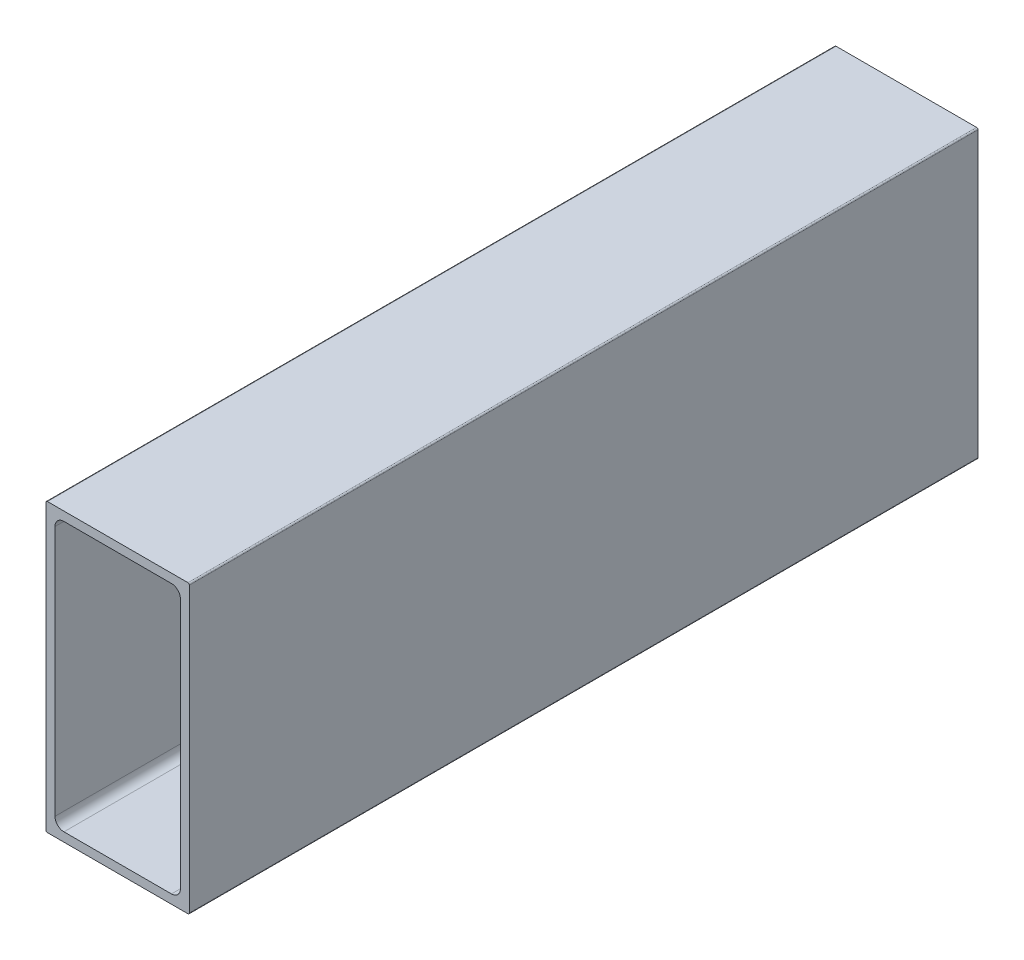
ISO-10303-21;
HEADER;
FILE_DESCRIPTION(('STEP AP214'),'2;1');
FILE_NAME('part.step','',(''),(''),'','','');
FILE_SCHEMA(('AUTOMOTIVE_DESIGN { 1 0 10303 214 1 1 1 1 }'));
ENDSEC;
DATA;
#1=APPLICATION_CONTEXT('core data for automotive mechanical design processes');
#2=APPLICATION_PROTOCOL_DEFINITION('international standard','automotive_design',2000,#1);
#3=PRODUCT_CONTEXT('',#1,'mechanical');
#4=PRODUCT('Part','Part','',(#3));
#5=PRODUCT_RELATED_PRODUCT_CATEGORY('part','',(#4));
#6=PRODUCT_DEFINITION_FORMATION('','',#4);
#7=PRODUCT_DEFINITION_CONTEXT('part definition',#1,'design');
#8=PRODUCT_DEFINITION('design','',#6,#7);
#9=PRODUCT_DEFINITION_SHAPE('','',#8);
#10=(LENGTH_UNIT() NAMED_UNIT(*) SI_UNIT(.MILLI.,.METRE.));
#11=(NAMED_UNIT(*) PLANE_ANGLE_UNIT() SI_UNIT($,.RADIAN.));
#12=(NAMED_UNIT(*) SI_UNIT($,.STERADIAN.) SOLID_ANGLE_UNIT());
#13=UNCERTAINTY_MEASURE_WITH_UNIT(LENGTH_MEASURE(1.E-05),#10,'distance_accuracy_value','');
#14=(GEOMETRIC_REPRESENTATION_CONTEXT(3) GLOBAL_UNCERTAINTY_ASSIGNED_CONTEXT((#13)) GLOBAL_UNIT_ASSIGNED_CONTEXT((#10,
#11,#12)) REPRESENTATION_CONTEXT('',''));
#15=CARTESIAN_POINT('',(0.,0.,0.));
#16=DIRECTION('',(0.,0.,1.));
#17=DIRECTION('',(1.,0.,0.));
#18=AXIS2_PLACEMENT_3D('',#15,#16,#17);
#19=CARTESIAN_POINT('',(12.446,25.146,139.7));
#20=DIRECTION('',(0.,0.,-1.));
#21=DIRECTION('',(-1.,0.,0.));
#22=AXIS2_PLACEMENT_3D('',#19,#20,#21);
#23=CYLINDRICAL_SURFACE('',#22,0.253999999999998);
#24=CARTESIAN_POINT('',(12.446,25.146,0.));
#25=DIRECTION('',(0.,0.,-1.));
#26=DIRECTION('',(-1.,0.,0.));
#27=AXIS2_PLACEMENT_3D('',#24,#25,#26);
#28=CIRCLE('',#27,0.253999999999998);
#29=CARTESIAN_POINT('',(12.446,25.4,0.));
#30=VERTEX_POINT('',#29);
#31=CARTESIAN_POINT('',(12.7,25.146,0.));
#32=VERTEX_POINT('',#31);
#33=EDGE_CURVE('E228',#30,#32,#28,.T.);
#34=ORIENTED_EDGE('',*,*,#33,.F.);
#35=DIRECTION('',(0.,0.,-1.));
#36=VECTOR('',#35,1.);
#37=CARTESIAN_POINT('',(12.446,25.4,139.7));
#38=LINE('',#37,#36);
#39=CARTESIAN_POINT('',(12.446,25.4,139.7));
#40=VERTEX_POINT('',#39);
#41=EDGE_CURVE('E11',#40,#30,#38,.T.);
#42=ORIENTED_EDGE('',*,*,#41,.F.);
#43=CARTESIAN_POINT('',(12.446,25.146,139.7));
#44=DIRECTION('',(0.,0.,-1.));
#45=DIRECTION('',(-1.,0.,0.));
#46=AXIS2_PLACEMENT_3D('',#43,#44,#45);
#47=CIRCLE('',#46,0.253999999999998);
#48=CARTESIAN_POINT('',(12.7,25.146,139.7));
#49=VERTEX_POINT('',#48);
#50=EDGE_CURVE('E246',#40,#49,#47,.T.);
#51=ORIENTED_EDGE('',*,*,#50,.T.);
#52=DIRECTION('',(0.,0.,-1.));
#53=VECTOR('',#52,1.);
#54=CARTESIAN_POINT('',(12.7,25.146,139.7));
#55=LINE('',#54,#53);
#56=EDGE_CURVE('E42',#49,#32,#55,.T.);
#57=ORIENTED_EDGE('',*,*,#56,.T.);
#58=EDGE_LOOP('',(#34,#42,#51,#57));
#59=FACE_BOUND('',#58,.T.);
#60=ADVANCED_FACE('F39',(#59),#23,.T.);
#61=CARTESIAN_POINT('',(-12.446,25.4,139.7));
#62=DIRECTION('',(0.,1.,0.));
#63=DIRECTION('',(0.,0.,1.));
#64=AXIS2_PLACEMENT_3D('',#61,#62,#63);
#65=PLANE('',#64);
#66=DIRECTION('',(1.,0.,0.));
#67=VECTOR('',#66,1.);
#68=CARTESIAN_POINT('',(-12.446,25.4,0.));
#69=LINE('',#68,#67);
#70=CARTESIAN_POINT('',(-12.446,25.4,0.));
#71=VERTEX_POINT('',#70);
#72=EDGE_CURVE('E251',#71,#30,#69,.T.);
#73=ORIENTED_EDGE('',*,*,#72,.F.);
#74=DIRECTION('',(0.,0.,-1.));
#75=VECTOR('',#74,1.);
#76=CARTESIAN_POINT('',(-12.446,25.4,139.7));
#77=LINE('',#76,#75);
#78=CARTESIAN_POINT('',(-12.446,25.4,139.7));
#79=VERTEX_POINT('',#78);
#80=EDGE_CURVE('E48',#79,#71,#77,.T.);
#81=ORIENTED_EDGE('',*,*,#80,.F.);
#82=DIRECTION('',(1.,0.,0.));
#83=VECTOR('',#82,1.);
#84=CARTESIAN_POINT('',(-12.446,25.4,139.7));
#85=LINE('',#84,#83);
#86=EDGE_CURVE('E275',#79,#40,#85,.T.);
#87=ORIENTED_EDGE('',*,*,#86,.T.);
#88=ORIENTED_EDGE('',*,*,#41,.T.);
#89=EDGE_LOOP('',(#73,#81,#87,#88));
#90=FACE_BOUND('',#89,.T.);
#91=ADVANCED_FACE('F338',(#90),#65,.T.);
#92=CARTESIAN_POINT('',(-12.446,25.146,139.7));
#93=DIRECTION('',(0.,0.,-1.));
#94=DIRECTION('',(-1.,0.,0.));
#95=AXIS2_PLACEMENT_3D('',#92,#93,#94);
#96=CYLINDRICAL_SURFACE('',#95,0.253999999999998);
#97=CARTESIAN_POINT('',(-12.446,25.146,0.));
#98=DIRECTION('',(0.,0.,-1.));
#99=DIRECTION('',(-1.,0.,0.));
#100=AXIS2_PLACEMENT_3D('',#97,#98,#99);
#101=CIRCLE('',#100,0.253999999999998);
#102=CARTESIAN_POINT('',(-12.7,25.146,0.));
#103=VERTEX_POINT('',#102);
#104=EDGE_CURVE('E302',#103,#71,#101,.T.);
#105=ORIENTED_EDGE('',*,*,#104,.F.);
#106=DIRECTION('',(0.,0.,-1.));
#107=VECTOR('',#106,1.);
#108=CARTESIAN_POINT('',(-12.7,25.146,139.7));
#109=LINE('',#108,#107);
#110=CARTESIAN_POINT('',(-12.7,25.146,139.7));
#111=VERTEX_POINT('',#110);
#112=EDGE_CURVE('E311',#111,#103,#109,.T.);
#113=ORIENTED_EDGE('',*,*,#112,.F.);
#114=CARTESIAN_POINT('',(-12.446,25.146,139.7));
#115=DIRECTION('',(0.,0.,-1.));
#116=DIRECTION('',(-1.,0.,0.));
#117=AXIS2_PLACEMENT_3D('',#114,#115,#116);
#118=CIRCLE('',#117,0.253999999999998);
#119=EDGE_CURVE('E271',#111,#79,#118,.T.);
#120=ORIENTED_EDGE('',*,*,#119,.T.);
#121=ORIENTED_EDGE('',*,*,#80,.T.);
#122=EDGE_LOOP('',(#105,#113,#120,#121));
#123=FACE_BOUND('',#122,.T.);
#124=ADVANCED_FACE('F357',(#123),#96,.T.);
#125=CARTESIAN_POINT('',(-12.7,-25.146,139.7));
#126=DIRECTION('',(-1.,0.,0.));
#127=DIRECTION('',(0.,0.,1.));
#128=AXIS2_PLACEMENT_3D('',#125,#126,#127);
#129=PLANE('',#128);
#130=DIRECTION('',(0.,1.,0.));
#131=VECTOR('',#130,1.);
#132=CARTESIAN_POINT('',(-12.7,-25.146,0.));
#133=LINE('',#132,#131);
#134=CARTESIAN_POINT('',(-12.7,-25.146,0.));
#135=VERTEX_POINT('',#134);
#136=EDGE_CURVE('E298',#135,#103,#133,.T.);
#137=ORIENTED_EDGE('',*,*,#136,.F.);
#138=DIRECTION('',(0.,0.,-1.));
#139=VECTOR('',#138,1.);
#140=CARTESIAN_POINT('',(-12.7,-25.146,139.7));
#141=LINE('',#140,#139);
#142=CARTESIAN_POINT('',(-12.7,-25.146,139.7));
#143=VERTEX_POINT('',#142);
#144=EDGE_CURVE('E314',#143,#135,#141,.T.);
#145=ORIENTED_EDGE('',*,*,#144,.F.);
#146=DIRECTION('',(0.,1.,0.));
#147=VECTOR('',#146,1.);
#148=CARTESIAN_POINT('',(-12.7,-25.146,139.7));
#149=LINE('',#148,#147);
#150=EDGE_CURVE('E267',#143,#111,#149,.T.);
#151=ORIENTED_EDGE('',*,*,#150,.T.);
#152=ORIENTED_EDGE('',*,*,#112,.T.);
#153=EDGE_LOOP('',(#137,#145,#151,#152));
#154=FACE_BOUND('',#153,.T.);
#155=ADVANCED_FACE('F355',(#154),#129,.T.);
#156=CARTESIAN_POINT('',(-12.446,-25.146,139.7));
#157=DIRECTION('',(0.,0.,-1.));
#158=DIRECTION('',(-1.,0.,0.));
#159=AXIS2_PLACEMENT_3D('',#156,#157,#158);
#160=CYLINDRICAL_SURFACE('',#159,0.253999999999998);
#161=CARTESIAN_POINT('',(-12.446,-25.146,0.));
#162=DIRECTION('',(0.,0.,-1.));
#163=DIRECTION('',(-1.,0.,0.));
#164=AXIS2_PLACEMENT_3D('',#161,#162,#163);
#165=CIRCLE('',#164,0.253999999999998);
#166=CARTESIAN_POINT('',(-12.446,-25.4,0.));
#167=VERTEX_POINT('',#166);
#168=EDGE_CURVE('E294',#167,#135,#165,.T.);
#169=ORIENTED_EDGE('',*,*,#168,.F.);
#170=DIRECTION('',(0.,0.,-1.));
#171=VECTOR('',#170,1.);
#172=CARTESIAN_POINT('',(-12.446,-25.4,139.7));
#173=LINE('',#172,#171);
#174=CARTESIAN_POINT('',(-12.446,-25.4,139.7));
#175=VERTEX_POINT('',#174);
#176=EDGE_CURVE('E317',#175,#167,#173,.T.);
#177=ORIENTED_EDGE('',*,*,#176,.F.);
#178=CARTESIAN_POINT('',(-12.446,-25.146,139.7));
#179=DIRECTION('',(0.,0.,-1.));
#180=DIRECTION('',(-1.,0.,0.));
#181=AXIS2_PLACEMENT_3D('',#178,#179,#180);
#182=CIRCLE('',#181,0.253999999999998);
#183=EDGE_CURVE('E263',#175,#143,#182,.T.);
#184=ORIENTED_EDGE('',*,*,#183,.T.);
#185=ORIENTED_EDGE('',*,*,#144,.T.);
#186=EDGE_LOOP('',(#169,#177,#184,#185));
#187=FACE_BOUND('',#186,.T.);
#188=ADVANCED_FACE('F351',(#187),#160,.T.);
#189=CARTESIAN_POINT('',(12.446,-25.4,139.7));
#190=DIRECTION('',(0.,-1.,0.));
#191=DIRECTION('',(0.,0.,-1.));
#192=AXIS2_PLACEMENT_3D('',#189,#190,#191);
#193=PLANE('',#192);
#194=DIRECTION('',(-1.,0.,0.));
#195=VECTOR('',#194,1.);
#196=CARTESIAN_POINT('',(12.446,-25.4,0.));
#197=LINE('',#196,#195);
#198=CARTESIAN_POINT('',(12.446,-25.4,0.));
#199=VERTEX_POINT('',#198);
#200=EDGE_CURVE('E290',#199,#167,#197,.T.);
#201=ORIENTED_EDGE('',*,*,#200,.F.);
#202=DIRECTION('',(0.,0.,-1.));
#203=VECTOR('',#202,1.);
#204=CARTESIAN_POINT('',(12.446,-25.4,139.7));
#205=LINE('',#204,#203);
#206=CARTESIAN_POINT('',(12.446,-25.4,139.7));
#207=VERTEX_POINT('',#206);
#208=EDGE_CURVE('E320',#207,#199,#205,.T.);
#209=ORIENTED_EDGE('',*,*,#208,.F.);
#210=DIRECTION('',(-1.,0.,0.));
#211=VECTOR('',#210,1.);
#212=CARTESIAN_POINT('',(12.446,-25.4,139.7));
#213=LINE('',#212,#211);
#214=EDGE_CURVE('E259',#207,#175,#213,.T.);
#215=ORIENTED_EDGE('',*,*,#214,.T.);
#216=ORIENTED_EDGE('',*,*,#176,.T.);
#217=EDGE_LOOP('',(#201,#209,#215,#216));
#218=FACE_BOUND('',#217,.T.);
#219=ADVANCED_FACE('F349',(#218),#193,.T.);
#220=CARTESIAN_POINT('',(12.446,-25.146,139.7));
#221=DIRECTION('',(0.,0.,-1.));
#222=DIRECTION('',(-1.,0.,0.));
#223=AXIS2_PLACEMENT_3D('',#220,#221,#222);
#224=CYLINDRICAL_SURFACE('',#223,0.253999999999998);
#225=CARTESIAN_POINT('',(12.446,-25.146,0.));
#226=DIRECTION('',(0.,0.,-1.));
#227=DIRECTION('',(-1.,0.,0.));
#228=AXIS2_PLACEMENT_3D('',#225,#226,#227);
#229=CIRCLE('',#228,0.253999999999998);
#230=CARTESIAN_POINT('',(12.7,-25.146,0.));
#231=VERTEX_POINT('',#230);
#232=EDGE_CURVE('E286',#231,#199,#229,.T.);
#233=ORIENTED_EDGE('',*,*,#232,.F.);
#234=DIRECTION('',(0.,0.,-1.));
#235=VECTOR('',#234,1.);
#236=CARTESIAN_POINT('',(12.7,-25.146,139.7));
#237=LINE('',#236,#235);
#238=CARTESIAN_POINT('',(12.7,-25.146,139.7));
#239=VERTEX_POINT('',#238);
#240=EDGE_CURVE('E322',#239,#231,#237,.T.);
#241=ORIENTED_EDGE('',*,*,#240,.F.);
#242=CARTESIAN_POINT('',(12.446,-25.146,139.7));
#243=DIRECTION('',(0.,0.,-1.));
#244=DIRECTION('',(-1.,0.,0.));
#245=AXIS2_PLACEMENT_3D('',#242,#243,#244);
#246=CIRCLE('',#245,0.253999999999998);
#247=EDGE_CURVE('E255',#239,#207,#246,.T.);
#248=ORIENTED_EDGE('',*,*,#247,.T.);
#249=ORIENTED_EDGE('',*,*,#208,.T.);
#250=EDGE_LOOP('',(#233,#241,#248,#249));
#251=FACE_BOUND('',#250,.T.);
#252=ADVANCED_FACE('F345',(#251),#224,.T.);
#253=CARTESIAN_POINT('',(12.7,25.146,139.7));
#254=DIRECTION('',(1.,0.,0.));
#255=DIRECTION('',(0.,0.,-1.));
#256=AXIS2_PLACEMENT_3D('',#253,#254,#255);
#257=PLANE('',#256);
#258=DIRECTION('',(0.,-1.,0.));
#259=VECTOR('',#258,1.);
#260=CARTESIAN_POINT('',(12.7,25.146,0.));
#261=LINE('',#260,#259);
#262=EDGE_CURVE('E282',#32,#231,#261,.T.);
#263=ORIENTED_EDGE('',*,*,#262,.F.);
#264=ORIENTED_EDGE('',*,*,#56,.F.);
#265=DIRECTION('',(0.,-1.,0.));
#266=VECTOR('',#265,1.);
#267=CARTESIAN_POINT('',(12.7,25.146,139.7));
#268=LINE('',#267,#266);
#269=EDGE_CURVE('E250',#49,#239,#268,.T.);
#270=ORIENTED_EDGE('',*,*,#269,.T.);
#271=ORIENTED_EDGE('',*,*,#240,.T.);
#272=EDGE_LOOP('',(#263,#264,#270,#271));
#273=FACE_BOUND('',#272,.T.);
#274=ADVANCED_FACE('F332',(#273),#257,.T.);
#275=CARTESIAN_POINT('',(12.446,25.146,139.7));
#276=DIRECTION('',(0.,0.,-1.));
#277=DIRECTION('',(-1.,0.,0.));
#278=AXIS2_PLACEMENT_3D('',#275,#276,#277);
#279=PLANE('',#278);
#280=DIRECTION('',(0.,-1.,0.));
#281=VECTOR('',#280,1.);
#282=CARTESIAN_POINT('',(11.1125,-22.225,139.7));
#283=LINE('',#282,#281);
#284=CARTESIAN_POINT('',(11.1125,22.225,139.7));
#285=VERTEX_POINT('',#284);
#286=CARTESIAN_POINT('',(11.1125,-22.225,139.7));
#287=VERTEX_POINT('',#286);
#288=EDGE_CURVE('E162',#285,#287,#283,.T.);
#289=ORIENTED_EDGE('',*,*,#288,.T.);
#290=CARTESIAN_POINT('',(9.525,-22.225,139.7));
#291=DIRECTION('',(0.,0.,-1.));
#292=DIRECTION('',(1.,0.,0.));
#293=AXIS2_PLACEMENT_3D('',#290,#291,#292);
#294=CIRCLE('',#293,1.5875);
#295=CARTESIAN_POINT('',(9.525,-23.8125,139.7));
#296=VERTEX_POINT('',#295);
#297=EDGE_CURVE('E155',#287,#296,#294,.T.);
#298=ORIENTED_EDGE('',*,*,#297,.T.);
#299=DIRECTION('',(-1.,0.,0.));
#300=VECTOR('',#299,1.);
#301=CARTESIAN_POINT('',(-9.525,-23.8125,139.7));
#302=LINE('',#301,#300);
#303=CARTESIAN_POINT('',(-9.525,-23.8125,139.7));
#304=VERTEX_POINT('',#303);
#305=EDGE_CURVE('E165',#296,#304,#302,.T.);
#306=ORIENTED_EDGE('',*,*,#305,.T.);
#307=CARTESIAN_POINT('',(-9.525,-22.225,139.7));
#308=DIRECTION('',(0.,0.,-1.));
#309=DIRECTION('',(1.,0.,0.));
#310=AXIS2_PLACEMENT_3D('',#307,#308,#309);
#311=CIRCLE('',#310,1.5875);
#312=CARTESIAN_POINT('',(-11.1125,-22.225,139.7));
#313=VERTEX_POINT('',#312);
#314=EDGE_CURVE('E56',#304,#313,#311,.T.);
#315=ORIENTED_EDGE('',*,*,#314,.T.);
#316=DIRECTION('',(0.,1.,0.));
#317=VECTOR('',#316,1.);
#318=CARTESIAN_POINT('',(-11.1125,22.225,139.7));
#319=LINE('',#318,#317);
#320=CARTESIAN_POINT('',(-11.1125,22.225,139.7));
#321=VERTEX_POINT('',#320);
#322=EDGE_CURVE('E184',#313,#321,#319,.T.);
#323=ORIENTED_EDGE('',*,*,#322,.T.);
#324=CARTESIAN_POINT('',(-9.525,22.225,139.7));
#325=DIRECTION('',(0.,0.,-1.));
#326=DIRECTION('',(1.,0.,0.));
#327=AXIS2_PLACEMENT_3D('',#324,#325,#326);
#328=CIRCLE('',#327,1.5875);
#329=CARTESIAN_POINT('',(-9.525,23.8125,139.7));
#330=VERTEX_POINT('',#329);
#331=EDGE_CURVE('E188',#321,#330,#328,.T.);
#332=ORIENTED_EDGE('',*,*,#331,.T.);
#333=DIRECTION('',(1.,0.,0.));
#334=VECTOR('',#333,1.);
#335=CARTESIAN_POINT('',(9.525,23.8125,139.7));
#336=LINE('',#335,#334);
#337=CARTESIAN_POINT('',(9.525,23.8125,139.7));
#338=VERTEX_POINT('',#337);
#339=EDGE_CURVE('E192',#330,#338,#336,.T.);
#340=ORIENTED_EDGE('',*,*,#339,.T.);
#341=CARTESIAN_POINT('',(9.525,22.225,139.7));
#342=DIRECTION('',(0.,0.,-1.));
#343=DIRECTION('',(1.,0.,0.));
#344=AXIS2_PLACEMENT_3D('',#341,#342,#343);
#345=CIRCLE('',#344,1.5875);
#346=EDGE_CURVE('E196',#338,#285,#345,.T.);
#347=ORIENTED_EDGE('',*,*,#346,.T.);
#348=EDGE_LOOP('',(#289,#298,#306,#315,#323,#332,#340,#347));
#349=FACE_BOUND('',#348,.T.);
#350=ORIENTED_EDGE('',*,*,#50,.F.);
#351=ORIENTED_EDGE('',*,*,#86,.F.);
#352=ORIENTED_EDGE('',*,*,#119,.F.);
#353=ORIENTED_EDGE('',*,*,#150,.F.);
#354=ORIENTED_EDGE('',*,*,#183,.F.);
#355=ORIENTED_EDGE('',*,*,#214,.F.);
#356=ORIENTED_EDGE('',*,*,#247,.F.);
#357=ORIENTED_EDGE('',*,*,#269,.F.);
#358=EDGE_LOOP('',(#350,#351,#352,#353,#354,#355,#356,#357));
#359=FACE_BOUND('',#358,.T.);
#360=ADVANCED_FACE('F170',(#349,#359),#279,.F.);
#361=CARTESIAN_POINT('',(12.446,25.146,0.));
#362=DIRECTION('',(0.,0.,-1.));
#363=DIRECTION('',(-1.,0.,0.));
#364=AXIS2_PLACEMENT_3D('',#361,#362,#363);
#365=PLANE('',#364);
#366=CARTESIAN_POINT('',(9.525,-22.225,0.));
#367=DIRECTION('',(0.,0.,-1.));
#368=DIRECTION('',(1.,0.,0.));
#369=AXIS2_PLACEMENT_3D('',#366,#367,#368);
#370=CIRCLE('',#369,1.5875);
#371=CARTESIAN_POINT('',(11.1125,-22.225,0.));
#372=VERTEX_POINT('',#371);
#373=CARTESIAN_POINT('',(9.525,-23.8125,0.));
#374=VERTEX_POINT('',#373);
#375=EDGE_CURVE('E64',#372,#374,#370,.T.);
#376=ORIENTED_EDGE('',*,*,#375,.F.);
#377=DIRECTION('',(0.,-1.,0.));
#378=VECTOR('',#377,1.);
#379=CARTESIAN_POINT('',(11.1125,-22.225,0.));
#380=LINE('',#379,#378);
#381=CARTESIAN_POINT('',(11.1125,22.225,0.));
#382=VERTEX_POINT('',#381);
#383=EDGE_CURVE('E175',#382,#372,#380,.T.);
#384=ORIENTED_EDGE('',*,*,#383,.F.);
#385=CARTESIAN_POINT('',(9.525,22.225,0.));
#386=DIRECTION('',(0.,0.,-1.));
#387=DIRECTION('',(1.,0.,0.));
#388=AXIS2_PLACEMENT_3D('',#385,#386,#387);
#389=CIRCLE('',#388,1.5875);
#390=CARTESIAN_POINT('',(9.525,23.8125,0.));
#391=VERTEX_POINT('',#390);
#392=EDGE_CURVE('E179',#391,#382,#389,.T.);
#393=ORIENTED_EDGE('',*,*,#392,.F.);
#394=DIRECTION('',(1.,0.,0.));
#395=VECTOR('',#394,1.);
#396=CARTESIAN_POINT('',(9.525,23.8125,0.));
#397=LINE('',#396,#395);
#398=CARTESIAN_POINT('',(-9.525,23.8125,0.));
#399=VERTEX_POINT('',#398);
#400=EDGE_CURVE('E218',#399,#391,#397,.T.);
#401=ORIENTED_EDGE('',*,*,#400,.F.);
#402=CARTESIAN_POINT('',(-9.525,22.225,0.));
#403=DIRECTION('',(0.,0.,-1.));
#404=DIRECTION('',(1.,0.,0.));
#405=AXIS2_PLACEMENT_3D('',#402,#403,#404);
#406=CIRCLE('',#405,1.5875);
#407=CARTESIAN_POINT('',(-11.1125,22.225,0.));
#408=VERTEX_POINT('',#407);
#409=EDGE_CURVE('E214',#408,#399,#406,.T.);
#410=ORIENTED_EDGE('',*,*,#409,.F.);
#411=DIRECTION('',(0.,1.,0.));
#412=VECTOR('',#411,1.);
#413=CARTESIAN_POINT('',(-11.1125,22.225,0.));
#414=LINE('',#413,#412);
#415=CARTESIAN_POINT('',(-11.1125,-22.225,0.));
#416=VERTEX_POINT('',#415);
#417=EDGE_CURVE('E210',#416,#408,#414,.T.);
#418=ORIENTED_EDGE('',*,*,#417,.F.);
#419=CARTESIAN_POINT('',(-9.525,-22.225,0.));
#420=DIRECTION('',(0.,0.,-1.));
#421=DIRECTION('',(1.,0.,0.));
#422=AXIS2_PLACEMENT_3D('',#419,#420,#421);
#423=CIRCLE('',#422,1.5875);
#424=CARTESIAN_POINT('',(-9.525,-23.8125,0.));
#425=VERTEX_POINT('',#424);
#426=EDGE_CURVE('E206',#425,#416,#423,.T.);
#427=ORIENTED_EDGE('',*,*,#426,.F.);
#428=DIRECTION('',(-1.,0.,0.));
#429=VECTOR('',#428,1.);
#430=CARTESIAN_POINT('',(-9.525,-23.8125,0.));
#431=LINE('',#430,#429);
#432=EDGE_CURVE('E203',#374,#425,#431,.T.);
#433=ORIENTED_EDGE('',*,*,#432,.F.);
#434=EDGE_LOOP('',(#376,#384,#393,#401,#410,#418,#427,#433));
#435=FACE_BOUND('',#434,.T.);
#436=ORIENTED_EDGE('',*,*,#33,.T.);
#437=ORIENTED_EDGE('',*,*,#262,.T.);
#438=ORIENTED_EDGE('',*,*,#232,.T.);
#439=ORIENTED_EDGE('',*,*,#200,.T.);
#440=ORIENTED_EDGE('',*,*,#168,.T.);
#441=ORIENTED_EDGE('',*,*,#136,.T.);
#442=ORIENTED_EDGE('',*,*,#104,.T.);
#443=ORIENTED_EDGE('',*,*,#72,.T.);
#444=EDGE_LOOP('',(#436,#437,#438,#439,#440,#441,#442,#443));
#445=FACE_BOUND('',#444,.T.);
#446=ADVANCED_FACE('F334',(#435,#445),#365,.T.);
#447=CARTESIAN_POINT('',(9.525,-22.225,139.7));
#448=DIRECTION('',(0.,0.,-1.));
#449=DIRECTION('',(-1.,0.,0.));
#450=AXIS2_PLACEMENT_3D('',#447,#448,#449);
#451=CYLINDRICAL_SURFACE('',#450,1.5875);
#452=ORIENTED_EDGE('',*,*,#375,.T.);
#453=DIRECTION('',(0.,0.,-1.));
#454=VECTOR('',#453,1.);
#455=CARTESIAN_POINT('',(9.525,-23.8125,139.7));
#456=LINE('',#455,#454);
#457=EDGE_CURVE('E151',#296,#374,#456,.T.);
#458=ORIENTED_EDGE('',*,*,#457,.F.);
#459=ORIENTED_EDGE('',*,*,#297,.F.);
#460=DIRECTION('',(0.,0.,-1.));
#461=VECTOR('',#460,1.);
#462=CARTESIAN_POINT('',(11.1125,-22.225,139.7));
#463=LINE('',#462,#461);
#464=EDGE_CURVE('E225',#287,#372,#463,.T.);
#465=ORIENTED_EDGE('',*,*,#464,.T.);
#466=EDGE_LOOP('',(#452,#458,#459,#465));
#467=FACE_BOUND('',#466,.T.);
#468=ADVANCED_FACE('F153',(#467),#451,.F.);
#469=CARTESIAN_POINT('',(11.1125,-22.225,139.7));
#470=DIRECTION('',(1.,0.,0.));
#471=DIRECTION('',(0.,0.,-1.));
#472=AXIS2_PLACEMENT_3D('',#469,#470,#471);
#473=PLANE('',#472);
#474=ORIENTED_EDGE('',*,*,#383,.T.);
#475=ORIENTED_EDGE('',*,*,#464,.F.);
#476=ORIENTED_EDGE('',*,*,#288,.F.);
#477=DIRECTION('',(0.,0.,-1.));
#478=VECTOR('',#477,1.);
#479=CARTESIAN_POINT('',(11.1125,22.225,139.7));
#480=LINE('',#479,#478);
#481=EDGE_CURVE('E229',#285,#382,#480,.T.);
#482=ORIENTED_EDGE('',*,*,#481,.T.);
#483=EDGE_LOOP('',(#474,#475,#476,#482));
#484=FACE_BOUND('',#483,.T.);
#485=ADVANCED_FACE('F440',(#484),#473,.F.);
#486=CARTESIAN_POINT('',(9.525,22.225,139.7));
#487=DIRECTION('',(0.,0.,-1.));
#488=DIRECTION('',(-1.,0.,0.));
#489=AXIS2_PLACEMENT_3D('',#486,#487,#488);
#490=CYLINDRICAL_SURFACE('',#489,1.5875);
#491=ORIENTED_EDGE('',*,*,#392,.T.);
#492=ORIENTED_EDGE('',*,*,#481,.F.);
#493=ORIENTED_EDGE('',*,*,#346,.F.);
#494=DIRECTION('',(0.,0.,-1.));
#495=VECTOR('',#494,1.);
#496=CARTESIAN_POINT('',(9.525,23.8125,139.7));
#497=LINE('',#496,#495);
#498=EDGE_CURVE('E232',#338,#391,#497,.T.);
#499=ORIENTED_EDGE('',*,*,#498,.T.);
#500=EDGE_LOOP('',(#491,#492,#493,#499));
#501=FACE_BOUND('',#500,.T.);
#502=ADVANCED_FACE('F449',(#501),#490,.F.);
#503=CARTESIAN_POINT('',(9.525,23.8125,139.7));
#504=DIRECTION('',(0.,1.,0.));
#505=DIRECTION('',(0.,0.,1.));
#506=AXIS2_PLACEMENT_3D('',#503,#504,#505);
#507=PLANE('',#506);
#508=ORIENTED_EDGE('',*,*,#400,.T.);
#509=ORIENTED_EDGE('',*,*,#498,.F.);
#510=ORIENTED_EDGE('',*,*,#339,.F.);
#511=DIRECTION('',(0.,0.,-1.));
#512=VECTOR('',#511,1.);
#513=CARTESIAN_POINT('',(-9.525,23.8125,139.7));
#514=LINE('',#513,#512);
#515=EDGE_CURVE('E235',#330,#399,#514,.T.);
#516=ORIENTED_EDGE('',*,*,#515,.T.);
#517=EDGE_LOOP('',(#508,#509,#510,#516));
#518=FACE_BOUND('',#517,.T.);
#519=ADVANCED_FACE('F459',(#518),#507,.F.);
#520=CARTESIAN_POINT('',(-9.525,22.225,139.7));
#521=DIRECTION('',(0.,0.,-1.));
#522=DIRECTION('',(-1.,0.,0.));
#523=AXIS2_PLACEMENT_3D('',#520,#521,#522);
#524=CYLINDRICAL_SURFACE('',#523,1.5875);
#525=ORIENTED_EDGE('',*,*,#409,.T.);
#526=ORIENTED_EDGE('',*,*,#515,.F.);
#527=ORIENTED_EDGE('',*,*,#331,.F.);
#528=DIRECTION('',(0.,0.,-1.));
#529=VECTOR('',#528,1.);
#530=CARTESIAN_POINT('',(-11.1125,22.225,139.7));
#531=LINE('',#530,#529);
#532=EDGE_CURVE('E238',#321,#408,#531,.T.);
#533=ORIENTED_EDGE('',*,*,#532,.T.);
#534=EDGE_LOOP('',(#525,#526,#527,#533));
#535=FACE_BOUND('',#534,.T.);
#536=ADVANCED_FACE('F469',(#535),#524,.F.);
#537=CARTESIAN_POINT('',(-11.1125,22.225,139.7));
#538=DIRECTION('',(-1.,0.,0.));
#539=DIRECTION('',(0.,0.,1.));
#540=AXIS2_PLACEMENT_3D('',#537,#538,#539);
#541=PLANE('',#540);
#542=ORIENTED_EDGE('',*,*,#417,.T.);
#543=ORIENTED_EDGE('',*,*,#532,.F.);
#544=ORIENTED_EDGE('',*,*,#322,.F.);
#545=DIRECTION('',(0.,0.,-1.));
#546=VECTOR('',#545,1.);
#547=CARTESIAN_POINT('',(-11.1125,-22.225,139.7));
#548=LINE('',#547,#546);
#549=EDGE_CURVE('E241',#313,#416,#548,.T.);
#550=ORIENTED_EDGE('',*,*,#549,.T.);
#551=EDGE_LOOP('',(#542,#543,#544,#550));
#552=FACE_BOUND('',#551,.T.);
#553=ADVANCED_FACE('F479',(#552),#541,.F.);
#554=CARTESIAN_POINT('',(-9.525,-22.225,139.7));
#555=DIRECTION('',(0.,0.,-1.));
#556=DIRECTION('',(-1.,0.,0.));
#557=AXIS2_PLACEMENT_3D('',#554,#555,#556);
#558=CYLINDRICAL_SURFACE('',#557,1.5875);
#559=ORIENTED_EDGE('',*,*,#426,.T.);
#560=ORIENTED_EDGE('',*,*,#549,.F.);
#561=ORIENTED_EDGE('',*,*,#314,.F.);
#562=DIRECTION('',(0.,0.,-1.));
#563=VECTOR('',#562,1.);
#564=CARTESIAN_POINT('',(-9.525,-23.8125,139.7));
#565=LINE('',#564,#563);
#566=EDGE_CURVE('E161',#304,#425,#565,.T.);
#567=ORIENTED_EDGE('',*,*,#566,.T.);
#568=EDGE_LOOP('',(#559,#560,#561,#567));
#569=FACE_BOUND('',#568,.T.);
#570=ADVANCED_FACE('F489',(#569),#558,.F.);
#571=CARTESIAN_POINT('',(-9.525,-23.8125,139.7));
#572=DIRECTION('',(0.,-1.,0.));
#573=DIRECTION('',(0.,0.,-1.));
#574=AXIS2_PLACEMENT_3D('',#571,#572,#573);
#575=PLANE('',#574);
#576=ORIENTED_EDGE('',*,*,#432,.T.);
#577=ORIENTED_EDGE('',*,*,#566,.F.);
#578=ORIENTED_EDGE('',*,*,#305,.F.);
#579=ORIENTED_EDGE('',*,*,#457,.T.);
#580=EDGE_LOOP('',(#576,#577,#578,#579));
#581=FACE_BOUND('',#580,.T.);
#582=ADVANCED_FACE('F166',(#581),#575,.F.);
#583=CLOSED_SHELL('',(#60,#91,#124,#155,#188,#219,#252,#274,#360,#446,#468,#485,#502,#519,#536,
#553,#570,#582));
#584=MANIFOLD_SOLID_BREP('B2',#583);
#585=ADVANCED_BREP_SHAPE_REPRESENTATION('',(#18,#584),#14);
#586=SHAPE_DEFINITION_REPRESENTATION(#9,#585);
ENDSEC;
END-ISO-10303-21;
